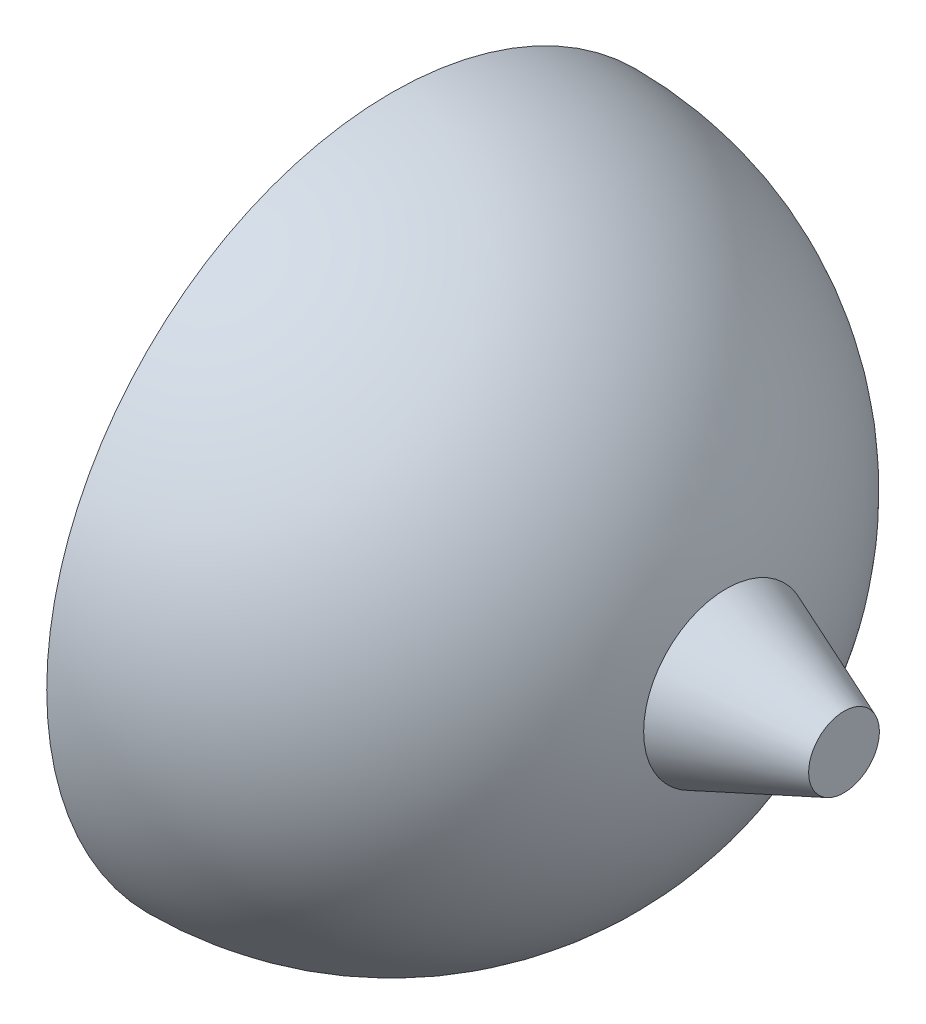
ISO-10303-21;
HEADER;
FILE_DESCRIPTION(('STEP AP214'),'2;1');
FILE_NAME('part.step','',(''),(''),'','','');
FILE_SCHEMA(('AUTOMOTIVE_DESIGN { 1 0 10303 214 1 1 1 1 }'));
ENDSEC;
DATA;
#1=APPLICATION_CONTEXT('core data for automotive mechanical design processes');
#2=APPLICATION_PROTOCOL_DEFINITION('international standard','automotive_design',2000,#1);
#3=PRODUCT_CONTEXT('',#1,'mechanical');
#4=PRODUCT('Part','Part','',(#3));
#5=PRODUCT_RELATED_PRODUCT_CATEGORY('part','',(#4));
#6=PRODUCT_DEFINITION_FORMATION('','',#4);
#7=PRODUCT_DEFINITION_CONTEXT('part definition',#1,'design');
#8=PRODUCT_DEFINITION('design','',#6,#7);
#9=PRODUCT_DEFINITION_SHAPE('','',#8);
#10=(LENGTH_UNIT() NAMED_UNIT(*) SI_UNIT(.MILLI.,.METRE.));
#11=(NAMED_UNIT(*) PLANE_ANGLE_UNIT() SI_UNIT($,.RADIAN.));
#12=(NAMED_UNIT(*) SI_UNIT($,.STERADIAN.) SOLID_ANGLE_UNIT());
#13=UNCERTAINTY_MEASURE_WITH_UNIT(LENGTH_MEASURE(1.E-05),#10,'distance_accuracy_value','');
#14=(GEOMETRIC_REPRESENTATION_CONTEXT(3) GLOBAL_UNCERTAINTY_ASSIGNED_CONTEXT((#13)) GLOBAL_UNIT_ASSIGNED_CONTEXT((#10,
#11,#12)) REPRESENTATION_CONTEXT('',''));
#15=CARTESIAN_POINT('',(0.,0.,0.));
#16=DIRECTION('',(0.,0.,1.));
#17=DIRECTION('',(1.,0.,0.));
#18=AXIS2_PLACEMENT_3D('',#15,#16,#17);
#19=CARTESIAN_POINT('',(0.,0.,0.));
#20=DIRECTION('',(1.,0.,0.));
#21=DIRECTION('',(0.,0.,1.));
#22=AXIS2_PLACEMENT_3D('',#19,#20,#21);
#23=SPHERICAL_SURFACE('',#22,2.925);
#24=CARTESIAN_POINT('',(0.,0.,0.));
#25=DIRECTION('',(1.,0.,0.));
#26=DIRECTION('',(0.,0.,-1.));
#27=AXIS2_PLACEMENT_3D('',#24,#25,#26);
#28=CIRCLE('',#27,2.925);
#29=CARTESIAN_POINT('',(0.,0.,-2.925));
#30=VERTEX_POINT('',#29);
#31=EDGE_CURVE('E10',#30,#30,#28,.T.);
#32=ORIENTED_EDGE('',*,*,#31,.T.);
#33=EDGE_LOOP('',(#32));
#34=FACE_BOUND('',#33,.T.);
#35=CARTESIAN_POINT('',(2.84000440140504,0.,0.));
#36=DIRECTION('',(-1.,0.,0.));
#37=DIRECTION('',(0.,0.,1.));
#38=AXIS2_PLACEMENT_3D('',#35,#36,#37);
#39=CIRCLE('',#38,0.7);
#40=CARTESIAN_POINT('',(2.84000440140504,0.,0.7));
#41=VERTEX_POINT('',#40);
#42=EDGE_CURVE('E60',#41,#41,#39,.T.);
#43=ORIENTED_EDGE('',*,*,#42,.T.);
#44=EDGE_LOOP('',(#43));
#45=FACE_BOUND('',#44,.T.);
#46=ADVANCED_FACE('F37',(#34,#45),#23,.T.);
#47=CARTESIAN_POINT('',(0.,0.,-2.925));
#48=DIRECTION('',(-1.,0.,0.));
#49=DIRECTION('',(0.,0.,1.));
#50=AXIS2_PLACEMENT_3D('',#47,#48,#49);
#51=PLANE('',#50);
#52=CARTESIAN_POINT('',(0.,0.,0.));
#53=DIRECTION('',(1.,0.,0.));
#54=DIRECTION('',(0.,0.,-1.));
#55=AXIS2_PLACEMENT_3D('',#52,#53,#54);
#56=CIRCLE('',#55,0.7);
#57=CARTESIAN_POINT('',(0.,0.,-0.7));
#58=VERTEX_POINT('',#57);
#59=EDGE_CURVE('E44',#58,#58,#56,.T.);
#60=ORIENTED_EDGE('',*,*,#59,.T.);
#61=EDGE_LOOP('',(#60));
#62=FACE_BOUND('',#61,.T.);
#63=ORIENTED_EDGE('',*,*,#31,.F.);
#64=EDGE_LOOP('',(#63));
#65=FACE_BOUND('',#64,.T.);
#66=ADVANCED_FACE('F79',(#62,#65),#51,.T.);
#67=CARTESIAN_POINT('',(0.,0.,0.));
#68=DIRECTION('',(1.,0.,0.));
#69=DIRECTION('',(0.,0.,-1.));
#70=AXIS2_PLACEMENT_3D('',#67,#68,#69);
#71=CONICAL_SURFACE('',#70,0.7,0.380506377112365);
#72=CARTESIAN_POINT('',(-1.,0.,0.));
#73=DIRECTION('',(1.,0.,0.));
#74=DIRECTION('',(0.,0.,-1.));
#75=AXIS2_PLACEMENT_3D('',#72,#73,#74);
#76=CIRCLE('',#75,0.3);
#77=CARTESIAN_POINT('',(-1.,0.,-0.3));
#78=VERTEX_POINT('',#77);
#79=EDGE_CURVE('E49',#78,#78,#76,.T.);
#80=ORIENTED_EDGE('',*,*,#79,.T.);
#81=EDGE_LOOP('',(#80));
#82=FACE_BOUND('',#81,.T.);
#83=ORIENTED_EDGE('',*,*,#59,.F.);
#84=EDGE_LOOP('',(#83));
#85=FACE_BOUND('',#84,.T.);
#86=ADVANCED_FACE('F83',(#82,#85),#71,.T.);
#87=CARTESIAN_POINT('',(-1.,0.,0.));
#88=DIRECTION('',(-1.,0.,0.));
#89=DIRECTION('',(0.,0.,1.));
#90=AXIS2_PLACEMENT_3D('',#87,#88,#89);
#91=PLANE('',#90);
#92=ORIENTED_EDGE('',*,*,#79,.F.);
#93=EDGE_LOOP('',(#92));
#94=FACE_BOUND('',#93,.T.);
#95=ADVANCED_FACE('F70',(#94),#91,.T.);
#96=CARTESIAN_POINT('',(3.84000440140504,0.,0.));
#97=DIRECTION('',(-1.,0.,0.));
#98=DIRECTION('',(0.,0.,1.));
#99=AXIS2_PLACEMENT_3D('',#96,#97,#98);
#100=CONICAL_SURFACE('',#99,0.3,0.380506377112365);
#101=ORIENTED_EDGE('',*,*,#42,.F.);
#102=EDGE_LOOP('',(#101));
#103=FACE_BOUND('',#102,.T.);
#104=CARTESIAN_POINT('',(3.84000440140504,0.,0.));
#105=DIRECTION('',(-1.,0.,0.));
#106=DIRECTION('',(0.,0.,1.));
#107=AXIS2_PLACEMENT_3D('',#104,#105,#106);
#108=CIRCLE('',#107,0.3);
#109=CARTESIAN_POINT('',(3.84000440140504,0.,0.3));
#110=VERTEX_POINT('',#109);
#111=EDGE_CURVE('E54',#110,#110,#108,.T.);
#112=ORIENTED_EDGE('',*,*,#111,.T.);
#113=EDGE_LOOP('',(#112));
#114=FACE_BOUND('',#113,.T.);
#115=ADVANCED_FACE('F66',(#103,#114),#100,.T.);
#116=CARTESIAN_POINT('',(3.84000440140504,0.,0.));
#117=DIRECTION('',(-1.,0.,0.));
#118=DIRECTION('',(0.,0.,1.));
#119=AXIS2_PLACEMENT_3D('',#116,#117,#118);
#120=PLANE('',#119);
#121=ORIENTED_EDGE('',*,*,#111,.F.);
#122=EDGE_LOOP('',(#121));
#123=FACE_BOUND('',#122,.T.);
#124=ADVANCED_FACE('F69',(#123),#120,.F.);
#125=CLOSED_SHELL('',(#46,#66,#86,#95,#115,#124));
#126=MANIFOLD_SOLID_BREP('B2',#125);
#127=ADVANCED_BREP_SHAPE_REPRESENTATION('',(#18,#126),#14);
#128=SHAPE_DEFINITION_REPRESENTATION(#9,#127);
ENDSEC;
END-ISO-10303-21;
